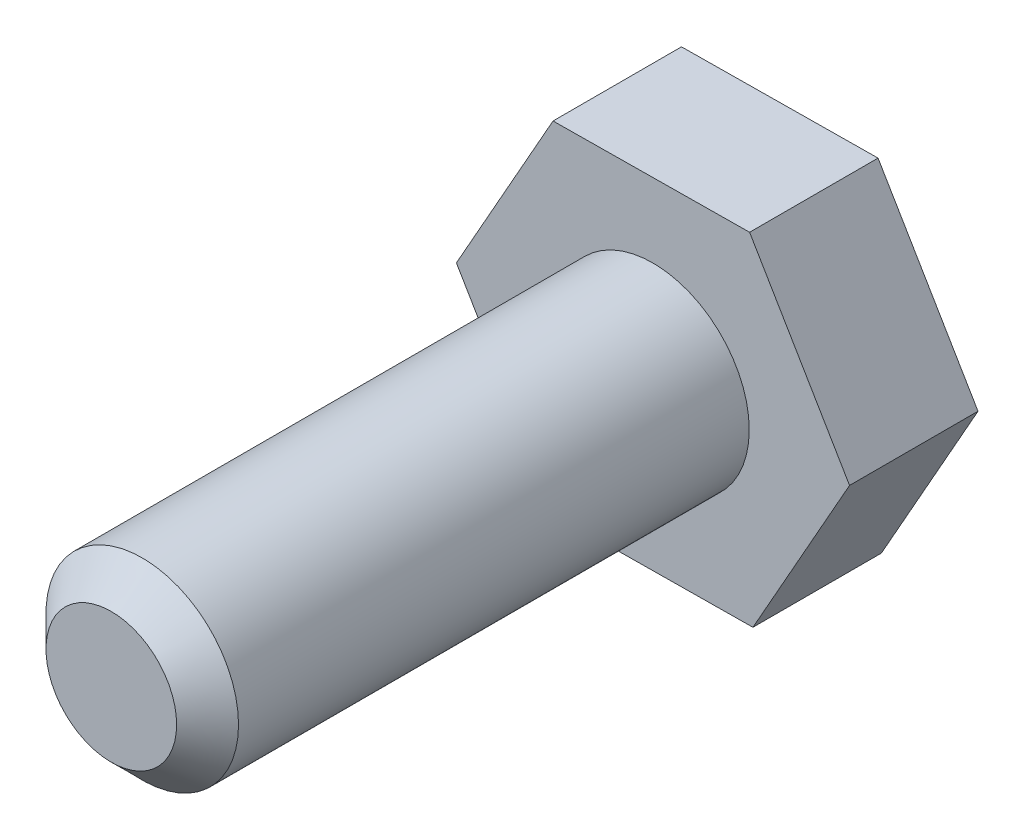
ISO-10303-21;
HEADER;
FILE_DESCRIPTION(('STEP AP214'),'2;1');
FILE_NAME('part.step','',(''),(''),'','','');
FILE_SCHEMA(('AUTOMOTIVE_DESIGN { 1 0 10303 214 1 1 1 1 }'));
ENDSEC;
DATA;
#1=APPLICATION_CONTEXT('core data for automotive mechanical design processes');
#2=APPLICATION_PROTOCOL_DEFINITION('international standard','automotive_design',2000,#1);
#3=PRODUCT_CONTEXT('',#1,'mechanical');
#4=PRODUCT('Part','Part','',(#3));
#5=PRODUCT_RELATED_PRODUCT_CATEGORY('part','',(#4));
#6=PRODUCT_DEFINITION_FORMATION('','',#4);
#7=PRODUCT_DEFINITION_CONTEXT('part definition',#1,'design');
#8=PRODUCT_DEFINITION('design','',#6,#7);
#9=PRODUCT_DEFINITION_SHAPE('','',#8);
#10=(LENGTH_UNIT() NAMED_UNIT(*) SI_UNIT(.MILLI.,.METRE.));
#11=(NAMED_UNIT(*) PLANE_ANGLE_UNIT() SI_UNIT($,.RADIAN.));
#12=(NAMED_UNIT(*) SI_UNIT($,.STERADIAN.) SOLID_ANGLE_UNIT());
#13=UNCERTAINTY_MEASURE_WITH_UNIT(LENGTH_MEASURE(1.E-05),#10,'distance_accuracy_value','');
#14=(GEOMETRIC_REPRESENTATION_CONTEXT(3) GLOBAL_UNCERTAINTY_ASSIGNED_CONTEXT((#13)) GLOBAL_UNIT_ASSIGNED_CONTEXT((#10,
#11,#12)) REPRESENTATION_CONTEXT('',''));
#15=CARTESIAN_POINT('',(0.,0.,0.));
#16=DIRECTION('',(0.,0.,1.));
#17=DIRECTION('',(1.,0.,0.));
#18=AXIS2_PLACEMENT_3D('',#15,#16,#17);
#19=CARTESIAN_POINT('',(3.12146200402984,5.5308053925926,4.15));
#20=DIRECTION('',(0.00978408793894536,-0.999952134666056,0.));
#21=DIRECTION('',(0.999952134666056,0.00978408793894536,0.));
#22=AXIS2_PLACEMENT_3D('',#19,#20,#21);
#23=PLANE('',#22);
#24=DIRECTION('',(-0.999952134666056,-0.00978408793894536,0.));
#25=VECTOR('',#24,1.);
#26=CARTESIAN_POINT('',(3.12146200402984,5.5308053925926,0.));
#27=LINE('',#26,#25);
#28=CARTESIAN_POINT('',(3.12146200402984,5.5308053925926,0.));
#29=VERTEX_POINT('',#28);
#30=CARTESIAN_POINT('',(-3.22908697135823,5.46866808873402,0.));
#31=VERTEX_POINT('',#30);
#32=EDGE_CURVE('E118',#29,#31,#27,.T.);
#33=ORIENTED_EDGE('',*,*,#32,.T.);
#34=DIRECTION('',(0.,0.,-1.));
#35=VECTOR('',#34,1.);
#36=CARTESIAN_POINT('',(-3.22908697135823,5.46866808873402,4.15));
#37=LINE('',#36,#35);
#38=CARTESIAN_POINT('',(-3.22908697135823,5.46866808873402,4.15));
#39=VERTEX_POINT('',#38);
#40=EDGE_CURVE('E136',#39,#31,#37,.T.);
#41=ORIENTED_EDGE('',*,*,#40,.F.);
#42=DIRECTION('',(-0.999952134666056,-0.00978408793894536,0.));
#43=VECTOR('',#42,1.);
#44=CARTESIAN_POINT('',(3.12146200402984,5.5308053925926,4.15));
#45=LINE('',#44,#43);
#46=CARTESIAN_POINT('',(3.12146200402984,5.5308053925926,4.15));
#47=VERTEX_POINT('',#46);
#48=EDGE_CURVE('E129',#47,#39,#45,.T.);
#49=ORIENTED_EDGE('',*,*,#48,.F.);
#50=DIRECTION('',(0.,0.,-1.));
#51=VECTOR('',#50,1.);
#52=CARTESIAN_POINT('',(3.12146200402984,5.5308053925926,4.15));
#53=LINE('',#52,#51);
#54=EDGE_CURVE('E114',#47,#29,#53,.T.);
#55=ORIENTED_EDGE('',*,*,#54,.T.);
#56=EDGE_LOOP('',(#33,#41,#49,#55));
#57=FACE_BOUND('',#56,.T.);
#58=ADVANCED_FACE('F32',(#57),#23,.F.);
#59=CARTESIAN_POINT('',(-3.22908697135823,5.46866808873402,4.15));
#60=DIRECTION('',(0.870875995158756,-0.49150279862504,0.));
#61=DIRECTION('',(0.49150279862504,0.870875995158756,0.));
#62=AXIS2_PLACEMENT_3D('',#59,#60,#61);
#63=PLANE('',#62);
#64=DIRECTION('',(-0.49150279862504,-0.870875995158756,0.));
#65=VECTOR('',#64,1.);
#66=CARTESIAN_POINT('',(-3.22908697135823,5.46866808873402,0.));
#67=LINE('',#66,#65);
#68=CARTESIAN_POINT('',(-6.35054897538807,-0.0621373038585775,0.));
#69=VERTEX_POINT('',#68);
#70=EDGE_CURVE('E121',#31,#69,#67,.T.);
#71=ORIENTED_EDGE('',*,*,#70,.T.);
#72=DIRECTION('',(0.,0.,-1.));
#73=VECTOR('',#72,1.);
#74=CARTESIAN_POINT('',(-6.35054897538807,-0.0621373038585775,4.15));
#75=LINE('',#74,#73);
#76=CARTESIAN_POINT('',(-6.35054897538807,-0.0621373038585775,4.15));
#77=VERTEX_POINT('',#76);
#78=EDGE_CURVE('E133',#77,#69,#75,.T.);
#79=ORIENTED_EDGE('',*,*,#78,.F.);
#80=DIRECTION('',(-0.49150279862504,-0.870875995158756,0.));
#81=VECTOR('',#80,1.);
#82=CARTESIAN_POINT('',(-3.22908697135823,5.46866808873402,4.15));
#83=LINE('',#82,#81);
#84=EDGE_CURVE('E87',#39,#77,#83,.T.);
#85=ORIENTED_EDGE('',*,*,#84,.F.);
#86=ORIENTED_EDGE('',*,*,#40,.T.);
#87=EDGE_LOOP('',(#71,#79,#85,#86));
#88=FACE_BOUND('',#87,.T.);
#89=ADVANCED_FACE('F151',(#88),#63,.F.);
#90=CARTESIAN_POINT('',(-6.35054897538807,-0.0621373038585775,4.15));
#91=DIRECTION('',(0.86109190721981,0.508449336041016,0.));
#92=DIRECTION('',(-0.508449336041016,0.86109190721981,0.));
#93=AXIS2_PLACEMENT_3D('',#90,#91,#92);
#94=PLANE('',#93);
#95=DIRECTION('',(0.508449336041016,-0.86109190721981,0.));
#96=VECTOR('',#95,1.);
#97=CARTESIAN_POINT('',(-6.35054897538807,-0.0621373038585775,0.));
#98=LINE('',#97,#96);
#99=CARTESIAN_POINT('',(-3.12146200402983,-5.5308053925926,0.));
#100=VERTEX_POINT('',#99);
#101=EDGE_CURVE('E124',#69,#100,#98,.T.);
#102=ORIENTED_EDGE('',*,*,#101,.T.);
#103=DIRECTION('',(0.,0.,-1.));
#104=VECTOR('',#103,1.);
#105=CARTESIAN_POINT('',(-3.12146200402983,-5.5308053925926,4.15));
#106=LINE('',#105,#104);
#107=CARTESIAN_POINT('',(-3.12146200402983,-5.5308053925926,4.15));
#108=VERTEX_POINT('',#107);
#109=EDGE_CURVE('E109',#108,#100,#106,.T.);
#110=ORIENTED_EDGE('',*,*,#109,.F.);
#111=DIRECTION('',(0.508449336041016,-0.86109190721981,0.));
#112=VECTOR('',#111,1.);
#113=CARTESIAN_POINT('',(-6.35054897538807,-0.0621373038585775,4.15));
#114=LINE('',#113,#112);
#115=EDGE_CURVE('E100',#77,#108,#114,.T.);
#116=ORIENTED_EDGE('',*,*,#115,.F.);
#117=ORIENTED_EDGE('',*,*,#78,.T.);
#118=EDGE_LOOP('',(#102,#110,#116,#117));
#119=FACE_BOUND('',#118,.T.);
#120=ADVANCED_FACE('F156',(#119),#94,.F.);
#121=CARTESIAN_POINT('',(-3.12146200402983,-5.5308053925926,4.15));
#122=DIRECTION('',(-0.00978408793894536,0.999952134666056,0.));
#123=DIRECTION('',(-0.999952134666056,-0.00978408793894536,0.));
#124=AXIS2_PLACEMENT_3D('',#121,#122,#123);
#125=PLANE('',#124);
#126=DIRECTION('',(0.999952134666056,0.00978408793894536,0.));
#127=VECTOR('',#126,1.);
#128=CARTESIAN_POINT('',(-3.12146200402983,-5.5308053925926,0.));
#129=LINE('',#128,#127);
#130=CARTESIAN_POINT('',(3.22908697135824,-5.46866808873402,0.));
#131=VERTEX_POINT('',#130);
#132=EDGE_CURVE('E108',#100,#131,#129,.T.);
#133=ORIENTED_EDGE('',*,*,#132,.T.);
#134=DIRECTION('',(0.,0.,-1.));
#135=VECTOR('',#134,1.);
#136=CARTESIAN_POINT('',(3.22908697135824,-5.46866808873402,4.15));
#137=LINE('',#136,#135);
#138=CARTESIAN_POINT('',(3.22908697135824,-5.46866808873402,4.15));
#139=VERTEX_POINT('',#138);
#140=EDGE_CURVE('E105',#139,#131,#137,.T.);
#141=ORIENTED_EDGE('',*,*,#140,.F.);
#142=DIRECTION('',(0.999952134666056,0.00978408793894536,0.));
#143=VECTOR('',#142,1.);
#144=CARTESIAN_POINT('',(-3.12146200402983,-5.5308053925926,4.15));
#145=LINE('',#144,#143);
#146=EDGE_CURVE('E94',#108,#139,#145,.T.);
#147=ORIENTED_EDGE('',*,*,#146,.F.);
#148=ORIENTED_EDGE('',*,*,#109,.T.);
#149=EDGE_LOOP('',(#133,#141,#147,#148));
#150=FACE_BOUND('',#149,.T.);
#151=ADVANCED_FACE('F106',(#150),#125,.F.);
#152=CARTESIAN_POINT('',(3.22908697135824,-5.46866808873402,4.15));
#153=DIRECTION('',(-0.870875995158756,0.49150279862504,0.));
#154=DIRECTION('',(-0.491502798625041,-0.870875995158756,0.));
#155=AXIS2_PLACEMENT_3D('',#152,#153,#154);
#156=PLANE('',#155);
#157=DIRECTION('',(0.49150279862504,0.870875995158756,0.));
#158=VECTOR('',#157,1.);
#159=CARTESIAN_POINT('',(3.22908697135824,-5.46866808873402,0.));
#160=LINE('',#159,#158);
#161=CARTESIAN_POINT('',(6.35054897538807,0.0621373038585754,0.));
#162=VERTEX_POINT('',#161);
#163=EDGE_CURVE('E72',#131,#162,#160,.T.);
#164=ORIENTED_EDGE('',*,*,#163,.T.);
#165=DIRECTION('',(0.,0.,-1.));
#166=VECTOR('',#165,1.);
#167=CARTESIAN_POINT('',(6.35054897538807,0.0621373038585754,4.15));
#168=LINE('',#167,#166);
#169=CARTESIAN_POINT('',(6.35054897538807,0.0621373038585754,4.15));
#170=VERTEX_POINT('',#169);
#171=EDGE_CURVE('E110',#170,#162,#168,.T.);
#172=ORIENTED_EDGE('',*,*,#171,.F.);
#173=DIRECTION('',(0.49150279862504,0.870875995158756,0.));
#174=VECTOR('',#173,1.);
#175=CARTESIAN_POINT('',(3.22908697135824,-5.46866808873402,4.15));
#176=LINE('',#175,#174);
#177=EDGE_CURVE('E98',#139,#170,#176,.T.);
#178=ORIENTED_EDGE('',*,*,#177,.F.);
#179=ORIENTED_EDGE('',*,*,#140,.T.);
#180=EDGE_LOOP('',(#164,#172,#178,#179));
#181=FACE_BOUND('',#180,.T.);
#182=ADVANCED_FACE('F112',(#181),#156,.F.);
#183=CARTESIAN_POINT('',(6.35054897538807,0.0621373038585754,4.15));
#184=DIRECTION('',(-0.86109190721981,-0.508449336041016,0.));
#185=DIRECTION('',(0.508449336041016,-0.86109190721981,0.));
#186=AXIS2_PLACEMENT_3D('',#183,#184,#185);
#187=PLANE('',#186);
#188=DIRECTION('',(-0.508449336041016,0.86109190721981,0.));
#189=VECTOR('',#188,1.);
#190=CARTESIAN_POINT('',(6.35054897538807,0.0621373038585754,0.));
#191=LINE('',#190,#189);
#192=EDGE_CURVE('E78',#162,#29,#191,.T.);
#193=ORIENTED_EDGE('',*,*,#192,.T.);
#194=ORIENTED_EDGE('',*,*,#54,.F.);
#195=DIRECTION('',(-0.508449336041016,0.86109190721981,0.));
#196=VECTOR('',#195,1.);
#197=CARTESIAN_POINT('',(6.35054897538807,0.0621373038585754,4.15));
#198=LINE('',#197,#196);
#199=EDGE_CURVE('E49',#170,#47,#198,.T.);
#200=ORIENTED_EDGE('',*,*,#199,.F.);
#201=ORIENTED_EDGE('',*,*,#171,.T.);
#202=EDGE_LOOP('',(#193,#194,#200,#201));
#203=FACE_BOUND('',#202,.T.);
#204=ADVANCED_FACE('F166',(#203),#187,.F.);
#205=CARTESIAN_POINT('',(0.,0.,4.15));
#206=DIRECTION('',(0.,0.,1.));
#207=DIRECTION('',(1.,0.,0.));
#208=AXIS2_PLACEMENT_3D('',#205,#206,#207);
#209=PLANE('',#208);
#210=CARTESIAN_POINT('',(0.,0.,4.15));
#211=DIRECTION('',(0.,0.,1.));
#212=DIRECTION('',(1.,0.,0.));
#213=AXIS2_PLACEMENT_3D('',#210,#211,#212);
#214=CIRCLE('',#213,3.11);
#215=CARTESIAN_POINT('',(3.11,0.,4.15));
#216=VERTEX_POINT('',#215);
#217=EDGE_CURVE('E122',#216,#216,#214,.T.);
#218=ORIENTED_EDGE('',*,*,#217,.F.);
#219=EDGE_LOOP('',(#218));
#220=FACE_BOUND('',#219,.T.);
#221=ORIENTED_EDGE('',*,*,#48,.T.);
#222=ORIENTED_EDGE('',*,*,#84,.T.);
#223=ORIENTED_EDGE('',*,*,#115,.T.);
#224=ORIENTED_EDGE('',*,*,#146,.T.);
#225=ORIENTED_EDGE('',*,*,#177,.T.);
#226=ORIENTED_EDGE('',*,*,#199,.T.);
#227=EDGE_LOOP('',(#221,#222,#223,#224,#225,#226));
#228=FACE_BOUND('',#227,.T.);
#229=ADVANCED_FACE('F96',(#220,#228),#209,.T.);
#230=CARTESIAN_POINT('',(0.,0.,0.));
#231=DIRECTION('',(0.,0.,1.));
#232=DIRECTION('',(1.,0.,0.));
#233=AXIS2_PLACEMENT_3D('',#230,#231,#232);
#234=PLANE('',#233);
#235=ORIENTED_EDGE('',*,*,#32,.F.);
#236=ORIENTED_EDGE('',*,*,#192,.F.);
#237=ORIENTED_EDGE('',*,*,#163,.F.);
#238=ORIENTED_EDGE('',*,*,#132,.F.);
#239=ORIENTED_EDGE('',*,*,#101,.F.);
#240=ORIENTED_EDGE('',*,*,#70,.F.);
#241=EDGE_LOOP('',(#235,#236,#237,#238,#239,#240));
#242=FACE_BOUND('',#241,.T.);
#243=ADVANCED_FACE('F169',(#242),#234,.F.);
#244=CARTESIAN_POINT('',(0.,0.,21.65));
#245=DIRECTION('',(0.,0.,-1.));
#246=DIRECTION('',(-1.,0.,0.));
#247=AXIS2_PLACEMENT_3D('',#244,#245,#246);
#248=CYLINDRICAL_SURFACE('',#247,3.11);
#249=CARTESIAN_POINT('',(0.,0.,20.65));
#250=DIRECTION('',(0.,0.,1.));
#251=DIRECTION('',(1.,0.,0.));
#252=AXIS2_PLACEMENT_3D('',#249,#250,#251);
#253=CIRCLE('',#252,3.11);
#254=CARTESIAN_POINT('',(3.11,0.,20.65));
#255=VERTEX_POINT('',#254);
#256=EDGE_CURVE('E11',#255,#255,#253,.F.);
#257=ORIENTED_EDGE('',*,*,#256,.T.);
#258=EDGE_LOOP('',(#257));
#259=FACE_BOUND('',#258,.T.);
#260=ORIENTED_EDGE('',*,*,#217,.T.);
#261=EDGE_LOOP('',(#260));
#262=FACE_BOUND('',#261,.T.);
#263=ADVANCED_FACE('F147',(#259,#262),#248,.T.);
#264=CARTESIAN_POINT('',(0.,0.,21.65));
#265=DIRECTION('',(0.,0.,1.));
#266=DIRECTION('',(1.,0.,0.));
#267=AXIS2_PLACEMENT_3D('',#264,#265,#266);
#268=PLANE('',#267);
#269=CARTESIAN_POINT('',(0.,0.,21.65));
#270=DIRECTION('',(0.,0.,1.));
#271=DIRECTION('',(1.,0.,0.));
#272=AXIS2_PLACEMENT_3D('',#269,#270,#271);
#273=CIRCLE('',#272,2.11);
#274=CARTESIAN_POINT('',(2.11,0.,21.65));
#275=VERTEX_POINT('',#274);
#276=EDGE_CURVE('E41',#275,#275,#273,.T.);
#277=ORIENTED_EDGE('',*,*,#276,.T.);
#278=EDGE_LOOP('',(#277));
#279=FACE_BOUND('',#278,.T.);
#280=ADVANCED_FACE('F140',(#279),#268,.T.);
#281=CARTESIAN_POINT('',(0.,0.,21.65));
#282=DIRECTION('',(0.,0.,-1.));
#283=DIRECTION('',(-1.,0.,0.));
#284=AXIS2_PLACEMENT_3D('',#281,#282,#283);
#285=CONICAL_SURFACE('',#284,2.11,0.785398163397446);
#286=ORIENTED_EDGE('',*,*,#256,.F.);
#287=EDGE_LOOP('',(#286));
#288=FACE_BOUND('',#287,.T.);
#289=ORIENTED_EDGE('',*,*,#276,.F.);
#290=EDGE_LOOP('',(#289));
#291=FACE_BOUND('',#290,.T.);
#292=ADVANCED_FACE('F34',(#288,#291),#285,.T.);
#293=CLOSED_SHELL('',(#58,#89,#120,#151,#182,#204,#229,#243,#263,#280,#292));
#294=MANIFOLD_SOLID_BREP('B2',#293);
#295=ADVANCED_BREP_SHAPE_REPRESENTATION('',(#18,#294),#14);
#296=SHAPE_DEFINITION_REPRESENTATION(#9,#295);
ENDSEC;
END-ISO-10303-21;
